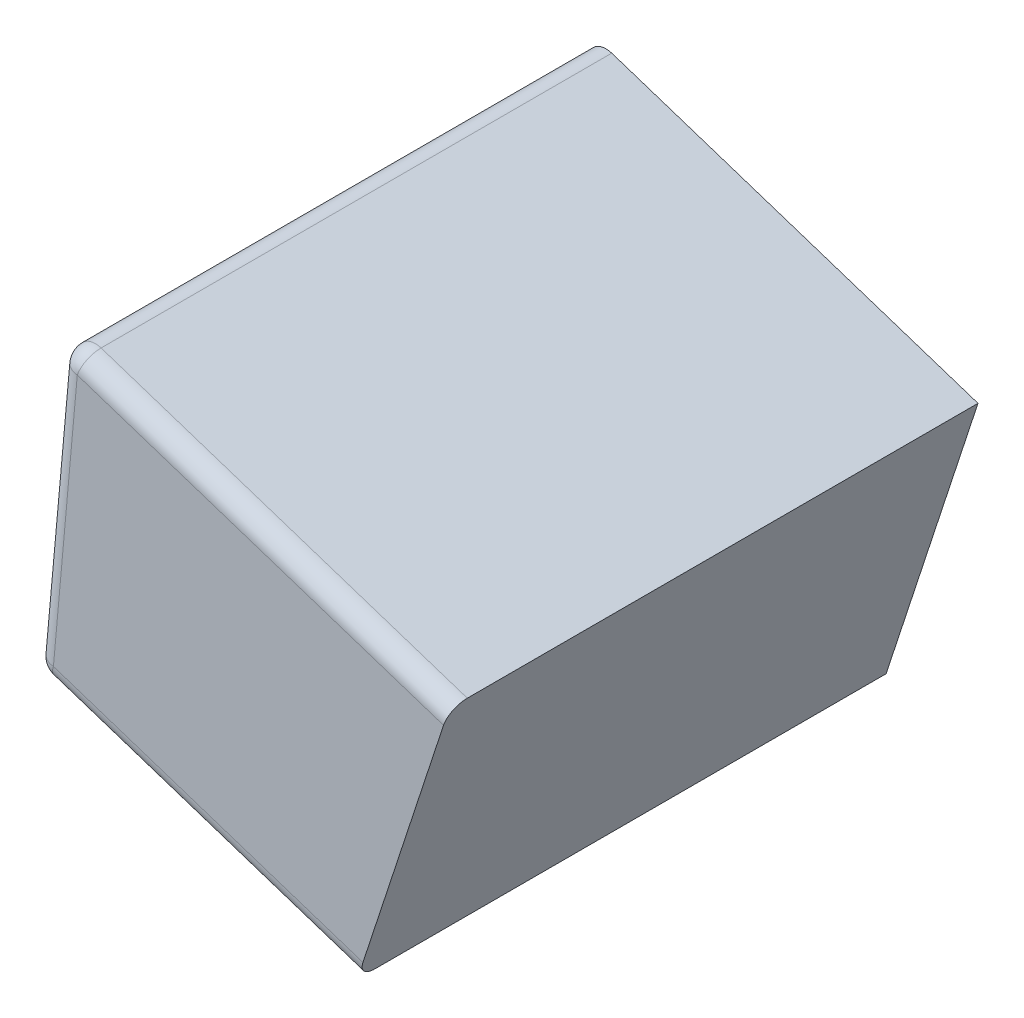
ISO-10303-21;
HEADER;
FILE_DESCRIPTION(('STEP AP214'),'2;1');
FILE_NAME('part.step','',(''),(''),'','','');
FILE_SCHEMA(('AUTOMOTIVE_DESIGN { 1 0 10303 214 1 1 1 1 }'));
ENDSEC;
DATA;
#1=APPLICATION_CONTEXT('core data for automotive mechanical design processes');
#2=APPLICATION_PROTOCOL_DEFINITION('international standard','automotive_design',2000,#1);
#3=PRODUCT_CONTEXT('',#1,'mechanical');
#4=PRODUCT('Part','Part','',(#3));
#5=PRODUCT_RELATED_PRODUCT_CATEGORY('part','',(#4));
#6=PRODUCT_DEFINITION_FORMATION('','',#4);
#7=PRODUCT_DEFINITION_CONTEXT('part definition',#1,'design');
#8=PRODUCT_DEFINITION('design','',#6,#7);
#9=PRODUCT_DEFINITION_SHAPE('','',#8);
#10=(LENGTH_UNIT() NAMED_UNIT(*) SI_UNIT(.MILLI.,.METRE.));
#11=(NAMED_UNIT(*) PLANE_ANGLE_UNIT() SI_UNIT($,.RADIAN.));
#12=(NAMED_UNIT(*) SI_UNIT($,.STERADIAN.) SOLID_ANGLE_UNIT());
#13=UNCERTAINTY_MEASURE_WITH_UNIT(LENGTH_MEASURE(1.E-05),#10,'distance_accuracy_value','');
#14=(GEOMETRIC_REPRESENTATION_CONTEXT(3) GLOBAL_UNCERTAINTY_ASSIGNED_CONTEXT((#13)) GLOBAL_UNIT_ASSIGNED_CONTEXT((#10,
#11,#12)) REPRESENTATION_CONTEXT('',''));
#15=CARTESIAN_POINT('',(0.,0.,0.));
#16=DIRECTION('',(0.,0.,1.));
#17=DIRECTION('',(1.,0.,0.));
#18=AXIS2_PLACEMENT_3D('',#15,#16,#17);
#19=CARTESIAN_POINT('',(322.852981493586,359.973302076131,320.548936371748));
#20=DIRECTION('',(0.311692939950405,0.950182883020466,0.));
#21=DIRECTION('',(-0.950182883020466,0.311692939950405,0.));
#22=AXIS2_PLACEMENT_3D('',#19,#20,#21);
#23=PLANE('',#22);
#24=DIRECTION('',(0.950182883020466,-0.311692939950405,0.));
#25=VECTOR('',#24,1.);
#26=CARTESIAN_POINT('',(277.604402796009,374.816405203806,71.4850000029994));
#27=LINE('',#26,#25);
#28=CARTESIAN_POINT('',(322.852981493587,359.973302076131,71.4850000029992));
#29=VERTEX_POINT('',#28);
#30=CARTESIAN_POINT('',(279.524159161108,374.186658534907,71.4850000029994));
#31=VERTEX_POINT('',#30);
#32=EDGE_CURVE('E175',#29,#31,#27,.F.);
#33=ORIENTED_EDGE('',*,*,#32,.T.);
#34=DIRECTION('',(0.,0.,-1.));
#35=VECTOR('',#34,1.);
#36=CARTESIAN_POINT('',(279.524159161107,374.186658534908,320.548936371749));
#37=LINE('',#36,#35);
#38=CARTESIAN_POINT('',(279.524159161108,374.186658534909,-7.49400541621981E-13));
#39=VERTEX_POINT('',#38);
#40=EDGE_CURVE('E179',#31,#39,#37,.T.);
#41=ORIENTED_EDGE('',*,*,#40,.T.);
#42=DIRECTION('',(0.950182883020466,-0.311692939950405,0.));
#43=VECTOR('',#42,1.);
#44=CARTESIAN_POINT('',(322.852981493588,359.973302076133,-7.49400541621981E-13));
#45=LINE('',#44,#43);
#46=CARTESIAN_POINT('',(322.852981493588,359.973302076133,-7.49400541621981E-13));
#47=VERTEX_POINT('',#46);
#48=EDGE_CURVE('E169',#39,#47,#45,.T.);
#49=ORIENTED_EDGE('',*,*,#48,.T.);
#50=DIRECTION('',(0.,0.,-1.));
#51=VECTOR('',#50,1.);
#52=CARTESIAN_POINT('',(322.852981493586,359.973302076131,320.548936371748));
#53=LINE('',#52,#51);
#54=EDGE_CURVE('E168',#29,#47,#53,.T.);
#55=ORIENTED_EDGE('',*,*,#54,.F.);
#56=EDGE_LOOP('',(#33,#41,#49,#55));
#57=FACE_BOUND('',#56,.T.);
#58=ADVANCED_FACE('F36',(#57),#23,.F.);
#59=CARTESIAN_POINT('',(335.71810759004,399.192100572801,320.548936371751));
#60=DIRECTION('',(-0.950182883020466,0.311692939950405,0.));
#61=DIRECTION('',(-0.311692939950405,-0.950182883020466,0.));
#62=AXIS2_PLACEMENT_3D('',#59,#60,#61);
#63=PLANE('',#62);
#64=DIRECTION('',(0.311692939950405,0.950182883020466,0.));
#65=VECTOR('',#64,1.);
#66=CARTESIAN_POINT('',(335.718107590045,399.1921005728,74.0250000029989));
#67=LINE('',#66,#65);
#68=CARTESIAN_POINT('',(323.644681561063,362.386766599005,74.025000002999));
#69=VERTEX_POINT('',#68);
#70=CARTESIAN_POINT('',(334.926407522566,396.77863604993,74.0250000029995));
#71=VERTEX_POINT('',#70);
#72=EDGE_CURVE('E161',#69,#71,#67,.T.);
#73=ORIENTED_EDGE('',*,*,#72,.F.);
#74=CARTESIAN_POINT('',(323.64468156106,362.386766599005,71.485000002999));
#75=DIRECTION('',(-0.950182883020466,0.311692939950405,0.));
#76=DIRECTION('',(-0.311692939950405,-0.950182883020466,0.));
#77=AXIS2_PLACEMENT_3D('',#74,#75,#76);
#78=CIRCLE('',#77,2.54);
#79=EDGE_CURVE('E200',#69,#29,#78,.F.);
#80=ORIENTED_EDGE('',*,*,#79,.T.);
#81=ORIENTED_EDGE('',*,*,#54,.T.);
#82=DIRECTION('',(0.311692939950405,0.950182883020466,0.));
#83=VECTOR('',#82,1.);
#84=CARTESIAN_POINT('',(335.718107590042,399.192100572801,-7.49400541621981E-13));
#85=LINE('',#84,#83);
#86=CARTESIAN_POINT('',(335.718107590042,399.192100572801,-7.49400541621981E-13));
#87=VERTEX_POINT('',#86);
#88=EDGE_CURVE('E165',#47,#87,#85,.T.);
#89=ORIENTED_EDGE('',*,*,#88,.T.);
#90=DIRECTION('',(0.,0.,-1.));
#91=VECTOR('',#90,1.);
#92=CARTESIAN_POINT('',(335.71810759004,399.192100572801,320.548936371751));
#93=LINE('',#92,#91);
#94=CARTESIAN_POINT('',(335.71810759004,399.192100572799,71.4850000029988));
#95=VERTEX_POINT('',#94);
#96=EDGE_CURVE('E164',#95,#87,#93,.T.);
#97=ORIENTED_EDGE('',*,*,#96,.F.);
#98=CARTESIAN_POINT('',(334.926407522564,396.77863604993,71.4850000029994));
#99=DIRECTION('',(-0.950182883020466,0.311692939950405,0.));
#100=DIRECTION('',(-0.311692939950405,-0.950182883020466,0.));
#101=AXIS2_PLACEMENT_3D('',#98,#99,#100);
#102=CIRCLE('',#101,2.54);
#103=EDGE_CURVE('E198',#95,#71,#102,.F.);
#104=ORIENTED_EDGE('',*,*,#103,.T.);
#105=EDGE_LOOP('',(#73,#80,#81,#89,#97,#104));
#106=FACE_BOUND('',#105,.T.);
#107=ADVANCED_FACE('F245',(#106),#63,.F.);
#108=CARTESIAN_POINT('',(281.415155825423,417.005352090969,320.548936371749));
#109=DIRECTION('',(-0.311692939950405,-0.950182883020466,0.));
#110=DIRECTION('',(0.950182883020466,-0.311692939950405,0.));
#111=AXIS2_PLACEMENT_3D('',#108,#109,#110);
#112=PLANE('',#111);
#113=DIRECTION('',(0.,0.,-1.));
#114=VECTOR('',#113,1.);
#115=CARTESIAN_POINT('',(284.449296568,416.010048697087,320.548936371749));
#116=LINE('',#115,#114);
#117=CARTESIAN_POINT('',(284.449296568003,416.010048697087,0.));
#118=VERTEX_POINT('',#117);
#119=CARTESIAN_POINT('',(284.449296568002,416.010048697084,71.4850000029995));
#120=VERTEX_POINT('',#119);
#121=EDGE_CURVE('E45',#118,#120,#116,.F.);
#122=ORIENTED_EDGE('',*,*,#121,.T.);
#123=DIRECTION('',(-0.950182883020466,0.311692939950405,0.));
#124=VECTOR('',#123,1.);
#125=CARTESIAN_POINT('',(335.718107590041,399.192100572799,71.4850000029988));
#126=LINE('',#125,#124);
#127=EDGE_CURVE('E12',#120,#95,#126,.F.);
#128=ORIENTED_EDGE('',*,*,#127,.T.);
#129=ORIENTED_EDGE('',*,*,#96,.T.);
#130=DIRECTION('',(-0.950182883020466,0.311692939950405,0.));
#131=VECTOR('',#130,1.);
#132=CARTESIAN_POINT('',(281.415155825423,417.005352090971,-1.66533453693773E-13));
#133=LINE('',#132,#131);
#134=EDGE_CURVE('E162',#87,#118,#133,.T.);
#135=ORIENTED_EDGE('',*,*,#134,.T.);
#136=EDGE_LOOP('',(#122,#128,#129,#135));
#137=FACE_BOUND('',#136,.T.);
#138=ADVANCED_FACE('F251',(#137),#112,.F.);
#139=CARTESIAN_POINT('',(277.60440279601,374.816405203809,320.548936371749));
#140=DIRECTION('',(0.995945412759858,-0.0899596287376289,0.));
#141=DIRECTION('',(0.0899596287376289,0.995945412759858,0.));
#142=AXIS2_PLACEMENT_3D('',#139,#140,#141);
#143=PLANE('',#142);
#144=DIRECTION('',(-0.0899596287376289,-0.995945412759858,0.));
#145=VECTOR('',#144,1.);
#146=CARTESIAN_POINT('',(277.604402796011,374.81640520381,0.));
#147=LINE('',#146,#145);
#148=CARTESIAN_POINT('',(281.127895152115,413.825081631209,0.));
#149=VERTEX_POINT('',#148);
#150=CARTESIAN_POINT('',(277.786157880172,376.828620514778,0.));
#151=VERTEX_POINT('',#150);
#152=EDGE_CURVE('E158',#149,#151,#147,.T.);
#153=ORIENTED_EDGE('',*,*,#152,.T.);
#154=DIRECTION('',(0.,0.,-1.));
#155=VECTOR('',#154,1.);
#156=CARTESIAN_POINT('',(277.786157880172,376.828620514777,320.548936371749));
#157=LINE('',#156,#155);
#158=CARTESIAN_POINT('',(277.786157880171,376.828620514777,71.4850000029983));
#159=VERTEX_POINT('',#158);
#160=EDGE_CURVE('E190',#151,#159,#157,.F.);
#161=ORIENTED_EDGE('',*,*,#160,.T.);
#162=DIRECTION('',(-0.0899596287376289,-0.995945412759858,0.));
#163=VECTOR('',#162,1.);
#164=CARTESIAN_POINT('',(281.415155825422,417.005352090968,71.4850000029995));
#165=LINE('',#164,#163);
#166=CARTESIAN_POINT('',(281.127895152113,413.825081631208,71.4850000029996));
#167=VERTEX_POINT('',#166);
#168=EDGE_CURVE('E188',#159,#167,#165,.F.);
#169=ORIENTED_EDGE('',*,*,#168,.T.);
#170=DIRECTION('',(0.,0.,-1.));
#171=VECTOR('',#170,1.);
#172=CARTESIAN_POINT('',(281.127895152113,413.825081631209,320.548936371749));
#173=LINE('',#172,#171);
#174=EDGE_CURVE('E186',#167,#149,#173,.T.);
#175=ORIENTED_EDGE('',*,*,#174,.T.);
#176=EDGE_LOOP('',(#153,#161,#169,#175));
#177=FACE_BOUND('',#176,.T.);
#178=ADVANCED_FACE('F313',(#177),#143,.F.);
#179=CARTESIAN_POINT('',(0.,0.,0.));
#180=DIRECTION('',(0.,0.,1.));
#181=DIRECTION('',(1.00000000000001,0.,0.));
#182=AXIS2_PLACEMENT_3D('',#179,#180,#181);
#183=PLANE('',#182);
#184=CARTESIAN_POINT('',(323.698740376242,393.110483865063,-8.88178419700125E-13));
#185=DIRECTION('',(0.,0.,-1.));
#186=DIRECTION('',(-1.00000000000001,0.,0.));
#187=AXIS2_PLACEMENT_3D('',#184,#185,#186);
#188=CIRCLE('',#187,2.99720000000003);
#189=CARTESIAN_POINT('',(320.701540376241,393.110483865063,-8.88178419700125E-13));
#190=VERTEX_POINT('',#189);
#191=EDGE_CURVE('E133',#190,#190,#188,.T.);
#192=ORIENTED_EDGE('',*,*,#191,.F.);
#193=EDGE_LOOP('',(#192));
#194=FACE_BOUND('',#193,.T.);
#195=CARTESIAN_POINT('',(289.824308357062,404.222472403149,1.0547118733939E-12));
#196=DIRECTION('',(0.,0.,-1.));
#197=DIRECTION('',(-1.00000000000001,0.,0.));
#198=AXIS2_PLACEMENT_3D('',#195,#196,#197);
#199=CIRCLE('',#198,2.99720000000003);
#200=CARTESIAN_POINT('',(286.827108357062,404.222472403149,1.0547118733939E-12));
#201=VERTEX_POINT('',#200);
#202=EDGE_CURVE('E139',#201,#201,#199,.T.);
#203=ORIENTED_EDGE('',*,*,#202,.F.);
#204=EDGE_LOOP('',(#203));
#205=FACE_BOUND('',#204,.T.);
#206=CARTESIAN_POINT('',(287.772364418149,381.505347156212,0.));
#207=DIRECTION('',(0.,0.,-1.));
#208=DIRECTION('',(-1.00000000000001,0.,0.));
#209=AXIS2_PLACEMENT_3D('',#206,#207,#208);
#210=CIRCLE('',#209,2.99720000000003);
#211=CARTESIAN_POINT('',(284.775164418149,381.505347156212,0.));
#212=VERTEX_POINT('',#211);
#213=EDGE_CURVE('E145',#212,#212,#210,.T.);
#214=ORIENTED_EDGE('',*,*,#213,.F.);
#215=EDGE_LOOP('',(#214));
#216=FACE_BOUND('',#215,.T.);
#217=CARTESIAN_POINT('',(316.771364785847,371.99266928993,-8.88178419700125E-13));
#218=DIRECTION('',(0.,0.,-1.));
#219=DIRECTION('',(-1.00000000000001,0.,0.));
#220=AXIS2_PLACEMENT_3D('',#217,#218,#219);
#221=CIRCLE('',#220,2.99720000000003);
#222=CARTESIAN_POINT('',(313.774164785847,371.99266928993,-8.88178419700125E-13));
#223=VERTEX_POINT('',#222);
#224=EDGE_CURVE('E151',#223,#223,#221,.T.);
#225=ORIENTED_EDGE('',*,*,#224,.F.);
#226=EDGE_LOOP('',(#225));
#227=FACE_BOUND('',#226,.T.);
#228=ORIENTED_EDGE('',*,*,#48,.F.);
#229=CARTESIAN_POINT('',(280.315859228582,376.600123057786,0.));
#230=DIRECTION('',(0.,0.,1.));
#231=DIRECTION('',(1.00000000000001,0.,0.));
#232=AXIS2_PLACEMENT_3D('',#229,#230,#231);
#233=CIRCLE('',#232,2.54);
#234=EDGE_CURVE('E184',#39,#151,#233,.F.);
#235=ORIENTED_EDGE('',*,*,#234,.T.);
#236=ORIENTED_EDGE('',*,*,#152,.F.);
#237=CARTESIAN_POINT('',(283.657596500525,413.596584174219,0.));
#238=DIRECTION('',(0.,0.,1.));
#239=DIRECTION('',(1.00000000000001,0.,0.));
#240=AXIS2_PLACEMENT_3D('',#237,#238,#239);
#241=CIRCLE('',#240,2.54);
#242=EDGE_CURVE('E182',#149,#118,#241,.F.);
#243=ORIENTED_EDGE('',*,*,#242,.T.);
#244=ORIENTED_EDGE('',*,*,#134,.F.);
#245=ORIENTED_EDGE('',*,*,#88,.F.);
#246=EDGE_LOOP('',(#228,#235,#236,#243,#244,#245));
#247=FACE_BOUND('',#246,.T.);
#248=ADVANCED_FACE('F259',(#194,#205,#216,#227,#247),#183,.F.);
#249=CARTESIAN_POINT('',(-313.774034821422,-375.700785936262,74.0250000029982));
#250=DIRECTION('',(0.,0.,1.));
#251=DIRECTION('',(0.,-1.00000000000001,0.));
#252=AXIS2_PLACEMENT_3D('',#249,#250,#251);
#253=PLANE('',#252);
#254=DIRECTION('',(-0.0899596287376289,-0.995945412759858,0.));
#255=VECTOR('',#254,1.);
#256=CARTESIAN_POINT('',(280.134104144421,374.587907746815,74.0250000029994));
#257=LINE('',#256,#255);
#258=CARTESIAN_POINT('',(283.657596500528,413.596584174216,74.0250000029999));
#259=VERTEX_POINT('',#258);
#260=CARTESIAN_POINT('',(280.315859228584,376.600123057784,74.0250000029994));
#261=VERTEX_POINT('',#260);
#262=EDGE_CURVE('E194',#259,#261,#257,.T.);
#263=ORIENTED_EDGE('',*,*,#262,.T.);
#264=DIRECTION('',(0.950182883020466,-0.311692939950405,0.));
#265=VECTOR('',#264,1.);
#266=CARTESIAN_POINT('',(323.644681561063,362.386766599005,74.025000002999));
#267=LINE('',#266,#265);
#268=EDGE_CURVE('E196',#261,#69,#267,.T.);
#269=ORIENTED_EDGE('',*,*,#268,.T.);
#270=ORIENTED_EDGE('',*,*,#72,.T.);
#271=DIRECTION('',(-0.950182883020466,0.311692939950405,0.));
#272=VECTOR('',#271,1.);
#273=CARTESIAN_POINT('',(280.623455757951,414.591887568094,74.0250000029991));
#274=LINE('',#273,#272);
#275=EDGE_CURVE('E192',#71,#259,#274,.T.);
#276=ORIENTED_EDGE('',*,*,#275,.T.);
#277=EDGE_LOOP('',(#263,#269,#270,#276));
#278=FACE_BOUND('',#277,.T.);
#279=ADVANCED_FACE('F256',(#278),#253,.T.);
#280=CARTESIAN_POINT('',(283.657596500523,413.596584174218,320.548936371749));
#281=DIRECTION('',(0.,0.,-1.));
#282=DIRECTION('',(-1.00000000000001,0.,0.));
#283=AXIS2_PLACEMENT_3D('',#280,#281,#282);
#284=CYLINDRICAL_SURFACE('',#283,2.54);
#285=ORIENTED_EDGE('',*,*,#242,.F.);
#286=ORIENTED_EDGE('',*,*,#174,.F.);
#287=CARTESIAN_POINT('',(283.657596500524,413.596584174216,71.4850000029999));
#288=DIRECTION('',(0.,0.,1.));
#289=DIRECTION('',(1.00000000000001,0.,0.));
#290=AXIS2_PLACEMENT_3D('',#287,#288,#289);
#291=CIRCLE('',#290,2.54);
#292=EDGE_CURVE('E172',#120,#167,#291,.T.);
#293=ORIENTED_EDGE('',*,*,#292,.F.);
#294=ORIENTED_EDGE('',*,*,#121,.F.);
#295=EDGE_LOOP('',(#285,#286,#293,#294));
#296=FACE_BOUND('',#295,.T.);
#297=ADVANCED_FACE('F38',(#296),#284,.T.);
#298=CARTESIAN_POINT('',(-21.9695754547894,513.852896361885,71.4850000029986));
#299=DIRECTION('',(0.950182883020466,-0.311692939950405,0.));
#300=DIRECTION('',(0.311692939950405,0.950182883020466,0.));
#301=AXIS2_PLACEMENT_3D('',#298,#299,#300);
#302=CYLINDRICAL_SURFACE('',#301,2.54);
#303=ORIENTED_EDGE('',*,*,#103,.F.);
#304=ORIENTED_EDGE('',*,*,#127,.F.);
#305=CARTESIAN_POINT('',(283.657596500524,413.596584174217,71.4850000029999));
#306=DIRECTION('',(-0.950182883020465,0.311692939950412,0.));
#307=DIRECTION('',(-0.311692939950412,-0.950182883020465,0.));
#308=AXIS2_PLACEMENT_3D('',#305,#306,#307);
#309=CIRCLE('',#308,2.54);
#310=EDGE_CURVE('E214',#259,#120,#309,.T.);
#311=ORIENTED_EDGE('',*,*,#310,.F.);
#312=ORIENTED_EDGE('',*,*,#275,.F.);
#313=EDGE_LOOP('',(#303,#304,#311,#312));
#314=FACE_BOUND('',#313,.T.);
#315=ADVANCED_FACE('F280',(#314),#302,.T.);
#316=CARTESIAN_POINT('',(283.657596500524,413.596584174216,71.4850000029999));
#317=DIRECTION('',(0.,0.,1.));
#318=DIRECTION('',(1.00000000000001,0.,0.));
#319=AXIS2_PLACEMENT_3D('',#316,#317,#318);
#320=SPHERICAL_SURFACE('',#319,2.54);
#321=ORIENTED_EDGE('',*,*,#310,.T.);
#322=ORIENTED_EDGE('',*,*,#292,.T.);
#323=CARTESIAN_POINT('',(283.657596500524,413.596584174216,71.4850000029999));
#324=DIRECTION('',(0.0899596287376188,0.995945412759858,0.));
#325=DIRECTION('',(-0.995945412759858,0.0899596287376188,0.));
#326=AXIS2_PLACEMENT_3D('',#323,#324,#325);
#327=CIRCLE('',#326,2.54);
#328=EDGE_CURVE('E211',#259,#167,#327,.F.);
#329=ORIENTED_EDGE('',*,*,#328,.F.);
#330=EDGE_LOOP('',(#321,#322,#329));
#331=FACE_BOUND('',#330,.T.);
#332=ADVANCED_FACE('F277',(#331),#320,.T.);
#333=CARTESIAN_POINT('',(208.105737921774,-422.840026702036,71.4850000029979));
#334=DIRECTION('',(0.0899596287376289,0.995945412759858,0.));
#335=DIRECTION('',(-0.995945412759858,0.0899596287376289,0.));
#336=AXIS2_PLACEMENT_3D('',#333,#334,#335);
#337=CYLINDRICAL_SURFACE('',#336,2.54);
#338=ORIENTED_EDGE('',*,*,#328,.T.);
#339=ORIENTED_EDGE('',*,*,#168,.F.);
#340=CARTESIAN_POINT('',(280.315859228582,376.600123057784,71.4850000029994));
#341=DIRECTION('',(-0.0899596287376198,-0.995945412759858,0.));
#342=DIRECTION('',(0.995945412759858,-0.0899596287376198,0.));
#343=AXIS2_PLACEMENT_3D('',#340,#341,#342);
#344=CIRCLE('',#343,2.54);
#345=EDGE_CURVE('E208',#261,#159,#344,.T.);
#346=ORIENTED_EDGE('',*,*,#345,.F.);
#347=ORIENTED_EDGE('',*,*,#262,.F.);
#348=EDGE_LOOP('',(#338,#339,#346,#347));
#349=FACE_BOUND('',#348,.T.);
#350=ADVANCED_FACE('F273',(#349),#337,.T.);
#351=CARTESIAN_POINT('',(-33.2513014162963,479.461026910956,71.4850000029988));
#352=DIRECTION('',(-0.950182883020466,0.311692939950405,0.));
#353=DIRECTION('',(-0.311692939950405,-0.950182883020466,0.));
#354=AXIS2_PLACEMENT_3D('',#351,#352,#353);
#355=CYLINDRICAL_SURFACE('',#354,2.54);
#356=ORIENTED_EDGE('',*,*,#79,.F.);
#357=ORIENTED_EDGE('',*,*,#268,.F.);
#358=CARTESIAN_POINT('',(280.315859228582,376.600123057785,71.4850000029994));
#359=DIRECTION('',(-0.950182883020465,0.311692939950412,0.));
#360=DIRECTION('',(-0.311692939950412,-0.950182883020465,0.));
#361=AXIS2_PLACEMENT_3D('',#358,#359,#360);
#362=CIRCLE('',#361,2.54);
#363=EDGE_CURVE('E205',#31,#261,#362,.T.);
#364=ORIENTED_EDGE('',*,*,#363,.F.);
#365=ORIENTED_EDGE('',*,*,#32,.F.);
#366=EDGE_LOOP('',(#356,#357,#364,#365));
#367=FACE_BOUND('',#366,.T.);
#368=ADVANCED_FACE('F269',(#367),#355,.T.);
#369=CARTESIAN_POINT('',(280.315859228582,376.600123057785,71.4850000029994));
#370=DIRECTION('',(0.,0.,1.));
#371=DIRECTION('',(1.00000000000001,0.,0.));
#372=AXIS2_PLACEMENT_3D('',#369,#370,#371);
#373=SPHERICAL_SURFACE('',#372,2.54);
#374=ORIENTED_EDGE('',*,*,#363,.T.);
#375=ORIENTED_EDGE('',*,*,#345,.T.);
#376=CARTESIAN_POINT('',(280.315859228582,376.600123057785,71.4850000029994));
#377=DIRECTION('',(0.,0.,1.));
#378=DIRECTION('',(1.00000000000001,0.,0.));
#379=AXIS2_PLACEMENT_3D('',#376,#377,#378);
#380=CIRCLE('',#379,2.54);
#381=EDGE_CURVE('E157',#31,#159,#380,.F.);
#382=ORIENTED_EDGE('',*,*,#381,.F.);
#383=EDGE_LOOP('',(#374,#375,#382));
#384=FACE_BOUND('',#383,.T.);
#385=ADVANCED_FACE('F265',(#384),#373,.T.);
#386=CARTESIAN_POINT('',(280.315859228581,376.600123057785,320.548936371749));
#387=DIRECTION('',(0.,0.,-1.));
#388=DIRECTION('',(-1.00000000000001,0.,0.));
#389=AXIS2_PLACEMENT_3D('',#386,#387,#388);
#390=CYLINDRICAL_SURFACE('',#389,2.54);
#391=ORIENTED_EDGE('',*,*,#381,.T.);
#392=ORIENTED_EDGE('',*,*,#160,.F.);
#393=ORIENTED_EDGE('',*,*,#234,.F.);
#394=ORIENTED_EDGE('',*,*,#40,.F.);
#395=EDGE_LOOP('',(#391,#392,#393,#394));
#396=FACE_BOUND('',#395,.T.);
#397=ADVANCED_FACE('F261',(#396),#390,.T.);
#398=CARTESIAN_POINT('',(316.771364785845,371.992669289926,4.69899999999912));
#399=DIRECTION('',(0.,0.,1.));
#400=DIRECTION('',(1.00000000000001,0.,0.));
#401=AXIS2_PLACEMENT_3D('',#398,#399,#400);
#402=PLANE('',#401);
#403=CARTESIAN_POINT('',(316.771364785845,371.992669289926,4.69899999999912));
#404=DIRECTION('',(0.,0.,1.));
#405=DIRECTION('',(1.00000000000001,0.,0.));
#406=AXIS2_PLACEMENT_3D('',#403,#404,#405);
#407=CIRCLE('',#406,2.45744999999997);
#408=CARTESIAN_POINT('',(319.228814785845,371.992669289926,4.69899999999912));
#409=VERTEX_POINT('',#408);
#410=EDGE_CURVE('E132',#409,#409,#407,.T.);
#411=ORIENTED_EDGE('',*,*,#410,.T.);
#412=EDGE_LOOP('',(#411));
#413=FACE_BOUND('',#412,.T.);
#414=CARTESIAN_POINT('',(316.771364785845,371.992669289926,4.69899999999912));
#415=DIRECTION('',(0.,0.,-1.));
#416=DIRECTION('',(-1.00000000000001,0.,0.));
#417=AXIS2_PLACEMENT_3D('',#414,#415,#416);
#418=CIRCLE('',#417,2.87019999999999);
#419=CARTESIAN_POINT('',(313.901164785845,371.992669289926,4.69899999999912));
#420=VERTEX_POINT('',#419);
#421=EDGE_CURVE('E154',#420,#420,#418,.T.);
#422=ORIENTED_EDGE('',*,*,#421,.T.);
#423=EDGE_LOOP('',(#422));
#424=FACE_BOUND('',#423,.T.);
#425=ADVANCED_FACE('F264',(#413,#424),#402,.F.);
#426=CARTESIAN_POINT('',(316.771364785847,371.99266928993,-8.88178419700125E-13));
#427=DIRECTION('',(0.,0.,-1.));
#428=DIRECTION('',(-1.00000000000001,0.,0.));
#429=AXIS2_PLACEMENT_3D('',#426,#427,#428);
#430=CONICAL_SURFACE('',#429,2.99720000000003,0.0270204491872741);
#431=ORIENTED_EDGE('',*,*,#421,.F.);
#432=EDGE_LOOP('',(#431));
#433=FACE_BOUND('',#432,.T.);
#434=ORIENTED_EDGE('',*,*,#224,.T.);
#435=EDGE_LOOP('',(#434));
#436=FACE_BOUND('',#435,.T.);
#437=ADVANCED_FACE('F325',(#433,#436),#430,.F.);
#438=CARTESIAN_POINT('',(287.772364418151,381.505347156209,4.69900000000001));
#439=DIRECTION('',(0.,0.,1.));
#440=DIRECTION('',(1.00000000000001,0.,0.));
#441=AXIS2_PLACEMENT_3D('',#438,#439,#440);
#442=PLANE('',#441);
#443=CARTESIAN_POINT('',(287.772364418151,381.505347156209,4.69900000000001));
#444=DIRECTION('',(0.,0.,1.));
#445=DIRECTION('',(1.00000000000001,0.,0.));
#446=AXIS2_PLACEMENT_3D('',#443,#444,#445);
#447=CIRCLE('',#446,2.45744999999997);
#448=CARTESIAN_POINT('',(290.229814418151,381.505347156209,4.69900000000001));
#449=VERTEX_POINT('',#448);
#450=EDGE_CURVE('E128',#449,#449,#447,.T.);
#451=ORIENTED_EDGE('',*,*,#450,.T.);
#452=EDGE_LOOP('',(#451));
#453=FACE_BOUND('',#452,.T.);
#454=CARTESIAN_POINT('',(287.772364418151,381.505347156209,4.69900000000001));
#455=DIRECTION('',(0.,0.,-1.));
#456=DIRECTION('',(-1.00000000000001,0.,0.));
#457=AXIS2_PLACEMENT_3D('',#454,#455,#456);
#458=CIRCLE('',#457,2.87019999999999);
#459=CARTESIAN_POINT('',(284.902164418151,381.505347156209,4.69900000000001));
#460=VERTEX_POINT('',#459);
#461=EDGE_CURVE('E148',#460,#460,#458,.T.);
#462=ORIENTED_EDGE('',*,*,#461,.T.);
#463=EDGE_LOOP('',(#462));
#464=FACE_BOUND('',#463,.T.);
#465=ADVANCED_FACE('F329',(#453,#464),#442,.F.);
#466=CARTESIAN_POINT('',(287.772364418149,381.505347156212,0.));
#467=DIRECTION('',(0.,0.,-1.));
#468=DIRECTION('',(-1.00000000000001,0.,0.));
#469=AXIS2_PLACEMENT_3D('',#466,#467,#468);
#470=CONICAL_SURFACE('',#469,2.99720000000003,0.0270204491872741);
#471=ORIENTED_EDGE('',*,*,#461,.F.);
#472=EDGE_LOOP('',(#471));
#473=FACE_BOUND('',#472,.T.);
#474=ORIENTED_EDGE('',*,*,#213,.T.);
#475=EDGE_LOOP('',(#474));
#476=FACE_BOUND('',#475,.T.);
#477=ADVANCED_FACE('F333',(#473,#476),#470,.F.);
#478=CARTESIAN_POINT('',(289.824308357061,404.222472403142,4.69900000000095));
#479=DIRECTION('',(0.,0.,1.));
#480=DIRECTION('',(1.00000000000001,0.,0.));
#481=AXIS2_PLACEMENT_3D('',#478,#479,#480);
#482=PLANE('',#481);
#483=CARTESIAN_POINT('',(289.824308357061,404.222472403142,4.69900000000095));
#484=DIRECTION('',(0.,0.,1.));
#485=DIRECTION('',(1.00000000000001,0.,0.));
#486=AXIS2_PLACEMENT_3D('',#483,#484,#485);
#487=CIRCLE('',#486,2.45744999999997);
#488=CARTESIAN_POINT('',(292.281758357061,404.222472403142,4.69900000000095));
#489=VERTEX_POINT('',#488);
#490=EDGE_CURVE('E124',#489,#489,#487,.T.);
#491=ORIENTED_EDGE('',*,*,#490,.T.);
#492=EDGE_LOOP('',(#491));
#493=FACE_BOUND('',#492,.T.);
#494=CARTESIAN_POINT('',(289.824308357061,404.222472403142,4.69900000000095));
#495=DIRECTION('',(0.,0.,-1.));
#496=DIRECTION('',(-1.00000000000001,0.,0.));
#497=AXIS2_PLACEMENT_3D('',#494,#495,#496);
#498=CIRCLE('',#497,2.87019999999999);
#499=CARTESIAN_POINT('',(286.954108357061,404.222472403142,4.69900000000095));
#500=VERTEX_POINT('',#499);
#501=EDGE_CURVE('E142',#500,#500,#498,.T.);
#502=ORIENTED_EDGE('',*,*,#501,.T.);
#503=EDGE_LOOP('',(#502));
#504=FACE_BOUND('',#503,.T.);
#505=ADVANCED_FACE('F225',(#493,#504),#482,.F.);
#506=CARTESIAN_POINT('',(289.824308357062,404.222472403149,1.0547118733939E-12));
#507=DIRECTION('',(0.,0.,-1.));
#508=DIRECTION('',(-1.00000000000001,0.,0.));
#509=AXIS2_PLACEMENT_3D('',#506,#507,#508);
#510=CONICAL_SURFACE('',#509,2.99720000000003,0.0270204491872741);
#511=ORIENTED_EDGE('',*,*,#501,.F.);
#512=EDGE_LOOP('',(#511));
#513=FACE_BOUND('',#512,.T.);
#514=ORIENTED_EDGE('',*,*,#202,.T.);
#515=EDGE_LOOP('',(#514));
#516=FACE_BOUND('',#515,.T.);
#517=ADVANCED_FACE('F340',(#513,#516),#510,.F.);
#518=CARTESIAN_POINT('',(323.698740376242,393.110483865057,4.69899999999912));
#519=DIRECTION('',(0.,0.,1.));
#520=DIRECTION('',(1.00000000000001,0.,0.));
#521=AXIS2_PLACEMENT_3D('',#518,#519,#520);
#522=PLANE('',#521);
#523=CARTESIAN_POINT('',(323.698740376242,393.110483865057,4.69899999999912));
#524=DIRECTION('',(0.,0.,1.));
#525=DIRECTION('',(1.00000000000001,0.,0.));
#526=AXIS2_PLACEMENT_3D('',#523,#524,#525);
#527=CIRCLE('',#526,2.45744999999997);
#528=CARTESIAN_POINT('',(326.156190376242,393.110483865057,4.69899999999912));
#529=VERTEX_POINT('',#528);
#530=EDGE_CURVE('E40',#529,#529,#527,.T.);
#531=ORIENTED_EDGE('',*,*,#530,.T.);
#532=EDGE_LOOP('',(#531));
#533=FACE_BOUND('',#532,.T.);
#534=CARTESIAN_POINT('',(323.698740376242,393.110483865057,4.69899999999912));
#535=DIRECTION('',(0.,0.,-1.));
#536=DIRECTION('',(-1.00000000000001,0.,0.));
#537=AXIS2_PLACEMENT_3D('',#534,#535,#536);
#538=CIRCLE('',#537,2.87019999999999);
#539=CARTESIAN_POINT('',(320.828540376242,393.110483865057,4.69899999999912));
#540=VERTEX_POINT('',#539);
#541=EDGE_CURVE('E136',#540,#540,#538,.T.);
#542=ORIENTED_EDGE('',*,*,#541,.T.);
#543=EDGE_LOOP('',(#542));
#544=FACE_BOUND('',#543,.T.);
#545=ADVANCED_FACE('F343',(#533,#544),#522,.F.);
#546=CARTESIAN_POINT('',(323.698740376242,393.110483865063,-8.88178419700125E-13));
#547=DIRECTION('',(0.,0.,-1.));
#548=DIRECTION('',(-1.00000000000001,0.,0.));
#549=AXIS2_PLACEMENT_3D('',#546,#547,#548);
#550=CONICAL_SURFACE('',#549,2.99720000000003,0.0270204491872741);
#551=ORIENTED_EDGE('',*,*,#541,.F.);
#552=EDGE_LOOP('',(#551));
#553=FACE_BOUND('',#552,.T.);
#554=ORIENTED_EDGE('',*,*,#191,.T.);
#555=EDGE_LOOP('',(#554));
#556=FACE_BOUND('',#555,.T.);
#557=ADVANCED_FACE('F347',(#553,#556),#550,.F.);
#558=CARTESIAN_POINT('',(316.771364785847,371.99266928993,-8.88178419700125E-13));
#559=DIRECTION('',(0.,0.,-1.));
#560=DIRECTION('',(-1.00000000000001,0.,0.));
#561=AXIS2_PLACEMENT_3D('',#558,#559,#560);
#562=CYLINDRICAL_SURFACE('',#561,2.45744999999997);
#563=CARTESIAN_POINT('',(316.771364785849,371.992669289928,12.6999999999992));
#564=DIRECTION('',(0.,0.,-1.));
#565=DIRECTION('',(-1.00000000000001,0.,0.));
#566=AXIS2_PLACEMENT_3D('',#563,#564,#565);
#567=CIRCLE('',#566,2.45744999999997);
#568=CARTESIAN_POINT('',(314.313914785849,371.992669289928,12.6999999999992));
#569=VERTEX_POINT('',#568);
#570=EDGE_CURVE('E129',#569,#569,#567,.T.);
#571=ORIENTED_EDGE('',*,*,#570,.F.);
#572=EDGE_LOOP('',(#571));
#573=FACE_BOUND('',#572,.T.);
#574=ORIENTED_EDGE('',*,*,#410,.F.);
#575=EDGE_LOOP('',(#574));
#576=FACE_BOUND('',#575,.T.);
#577=ADVANCED_FACE('F351',(#573,#576),#562,.F.);
#578=CARTESIAN_POINT('',(316.771364785849,371.992669289928,12.6999999999992));
#579=DIRECTION('',(0.,0.,-1.));
#580=DIRECTION('',(-1.00000000000001,0.,0.));
#581=AXIS2_PLACEMENT_3D('',#578,#579,#580);
#582=CONICAL_SURFACE('',#581,2.45744999999997,1.02974425867665);
#583=CARTESIAN_POINT('',(316.771364785849,371.992669289928,14.1765849282284));
#584=VERTEX_POINT('',#583);
#585=VERTEX_LOOP('',#584);
#586=FACE_BOUND('',#585,.T.);
#587=ORIENTED_EDGE('',*,*,#570,.T.);
#588=EDGE_LOOP('',(#587));
#589=FACE_BOUND('',#588,.T.);
#590=ADVANCED_FACE('F353',(#586,#589),#582,.F.);
#591=CARTESIAN_POINT('',(287.772364418149,381.505347156212,0.));
#592=DIRECTION('',(0.,0.,-1.));
#593=DIRECTION('',(-1.00000000000001,0.,0.));
#594=AXIS2_PLACEMENT_3D('',#591,#592,#593);
#595=CYLINDRICAL_SURFACE('',#594,2.45744999999997);
#596=CARTESIAN_POINT('',(287.772364418151,381.50534715621,12.7));
#597=DIRECTION('',(0.,0.,-1.));
#598=DIRECTION('',(-1.00000000000001,0.,0.));
#599=AXIS2_PLACEMENT_3D('',#596,#597,#598);
#600=CIRCLE('',#599,2.45744999999997);
#601=CARTESIAN_POINT('',(285.314914418151,381.50534715621,12.7));
#602=VERTEX_POINT('',#601);
#603=EDGE_CURVE('E125',#602,#602,#600,.T.);
#604=ORIENTED_EDGE('',*,*,#603,.F.);
#605=EDGE_LOOP('',(#604));
#606=FACE_BOUND('',#605,.T.);
#607=ORIENTED_EDGE('',*,*,#450,.F.);
#608=EDGE_LOOP('',(#607));
#609=FACE_BOUND('',#608,.T.);
#610=ADVANCED_FACE('F240',(#606,#609),#595,.F.);
#611=CARTESIAN_POINT('',(287.772364418151,381.50534715621,12.7));
#612=DIRECTION('',(0.,0.,-1.));
#613=DIRECTION('',(-1.00000000000001,0.,0.));
#614=AXIS2_PLACEMENT_3D('',#611,#612,#613);
#615=CONICAL_SURFACE('',#614,2.45744999999997,1.02974425867665);
#616=CARTESIAN_POINT('',(287.772364418151,381.50534715621,14.1765849282294));
#617=VERTEX_POINT('',#616);
#618=VERTEX_LOOP('',#617);
#619=FACE_BOUND('',#618,.T.);
#620=ORIENTED_EDGE('',*,*,#603,.T.);
#621=EDGE_LOOP('',(#620));
#622=FACE_BOUND('',#621,.T.);
#623=ADVANCED_FACE('F231',(#619,#622),#615,.F.);
#624=CARTESIAN_POINT('',(289.824308357062,404.222472403149,1.0547118733939E-12));
#625=DIRECTION('',(0.,0.,-1.));
#626=DIRECTION('',(-1.00000000000001,0.,0.));
#627=AXIS2_PLACEMENT_3D('',#624,#625,#626);
#628=CYLINDRICAL_SURFACE('',#627,2.45744999999997);
#629=CARTESIAN_POINT('',(289.824308357063,404.222472403145,12.700000000001));
#630=DIRECTION('',(0.,0.,-1.));
#631=DIRECTION('',(-1.00000000000001,0.,0.));
#632=AXIS2_PLACEMENT_3D('',#629,#630,#631);
#633=CIRCLE('',#632,2.45744999999997);
#634=CARTESIAN_POINT('',(287.366858357063,404.222472403145,12.700000000001));
#635=VERTEX_POINT('',#634);
#636=EDGE_CURVE('E120',#635,#635,#633,.T.);
#637=ORIENTED_EDGE('',*,*,#636,.F.);
#638=EDGE_LOOP('',(#637));
#639=FACE_BOUND('',#638,.T.);
#640=ORIENTED_EDGE('',*,*,#490,.F.);
#641=EDGE_LOOP('',(#640));
#642=FACE_BOUND('',#641,.T.);
#643=ADVANCED_FACE('F228',(#639,#642),#628,.F.);
#644=CARTESIAN_POINT('',(289.824308357063,404.222472403145,12.700000000001));
#645=DIRECTION('',(0.,0.,-1.));
#646=DIRECTION('',(-1.00000000000001,0.,0.));
#647=AXIS2_PLACEMENT_3D('',#644,#645,#646);
#648=CONICAL_SURFACE('',#647,2.45744999999997,1.02974425867665);
#649=CARTESIAN_POINT('',(289.824308357063,404.222472403145,14.1765849282303));
#650=VERTEX_POINT('',#649);
#651=VERTEX_LOOP('',#650);
#652=FACE_BOUND('',#651,.T.);
#653=ORIENTED_EDGE('',*,*,#636,.T.);
#654=EDGE_LOOP('',(#653));
#655=FACE_BOUND('',#654,.T.);
#656=ADVANCED_FACE('F230',(#652,#655),#648,.F.);
#657=CARTESIAN_POINT('',(323.698740376242,393.110483865063,-8.88178419700125E-13));
#658=DIRECTION('',(0.,0.,-1.));
#659=DIRECTION('',(-1.00000000000001,0.,0.));
#660=AXIS2_PLACEMENT_3D('',#657,#658,#659);
#661=CYLINDRICAL_SURFACE('',#660,2.45744999999997);
#662=CARTESIAN_POINT('',(323.698740376242,393.11048386506,12.6999999999992));
#663=DIRECTION('',(0.,0.,-1.));
#664=DIRECTION('',(-1.00000000000001,0.,0.));
#665=AXIS2_PLACEMENT_3D('',#662,#663,#664);
#666=CIRCLE('',#665,2.45744999999997);
#667=CARTESIAN_POINT('',(321.241290376242,393.11048386506,12.6999999999992));
#668=VERTEX_POINT('',#667);
#669=EDGE_CURVE('E116',#668,#668,#666,.T.);
#670=ORIENTED_EDGE('',*,*,#669,.F.);
#671=EDGE_LOOP('',(#670));
#672=FACE_BOUND('',#671,.T.);
#673=ORIENTED_EDGE('',*,*,#530,.F.);
#674=EDGE_LOOP('',(#673));
#675=FACE_BOUND('',#674,.T.);
#676=ADVANCED_FACE('F112',(#672,#675),#661,.F.);
#677=CARTESIAN_POINT('',(323.698740376242,393.11048386506,12.6999999999992));
#678=DIRECTION('',(0.,0.,-1.));
#679=DIRECTION('',(-1.00000000000001,0.,0.));
#680=AXIS2_PLACEMENT_3D('',#677,#678,#679);
#681=CONICAL_SURFACE('',#680,2.45744999999997,1.02974425867665);
#682=CARTESIAN_POINT('',(323.698740376242,393.11048386506,14.1765849282284));
#683=VERTEX_POINT('',#682);
#684=VERTEX_LOOP('',#683);
#685=FACE_BOUND('',#684,.T.);
#686=ORIENTED_EDGE('',*,*,#669,.T.);
#687=EDGE_LOOP('',(#686));
#688=FACE_BOUND('',#687,.T.);
#689=ADVANCED_FACE('F109',(#685,#688),#681,.F.);
#690=CLOSED_SHELL('',(#58,#107,#138,#178,#248,#279,#297,#315,#332,#350,#368,#385,#397,#425,#437,
#465,#477,#505,#517,#545,#557,#577,#590,#610,#623,#643,#656,#676,#689));
#691=MANIFOLD_SOLID_BREP('B2',#690);
#692=ADVANCED_BREP_SHAPE_REPRESENTATION('',(#18,#691),#14);
#693=SHAPE_DEFINITION_REPRESENTATION(#9,#692);
ENDSEC;
END-ISO-10303-21;
